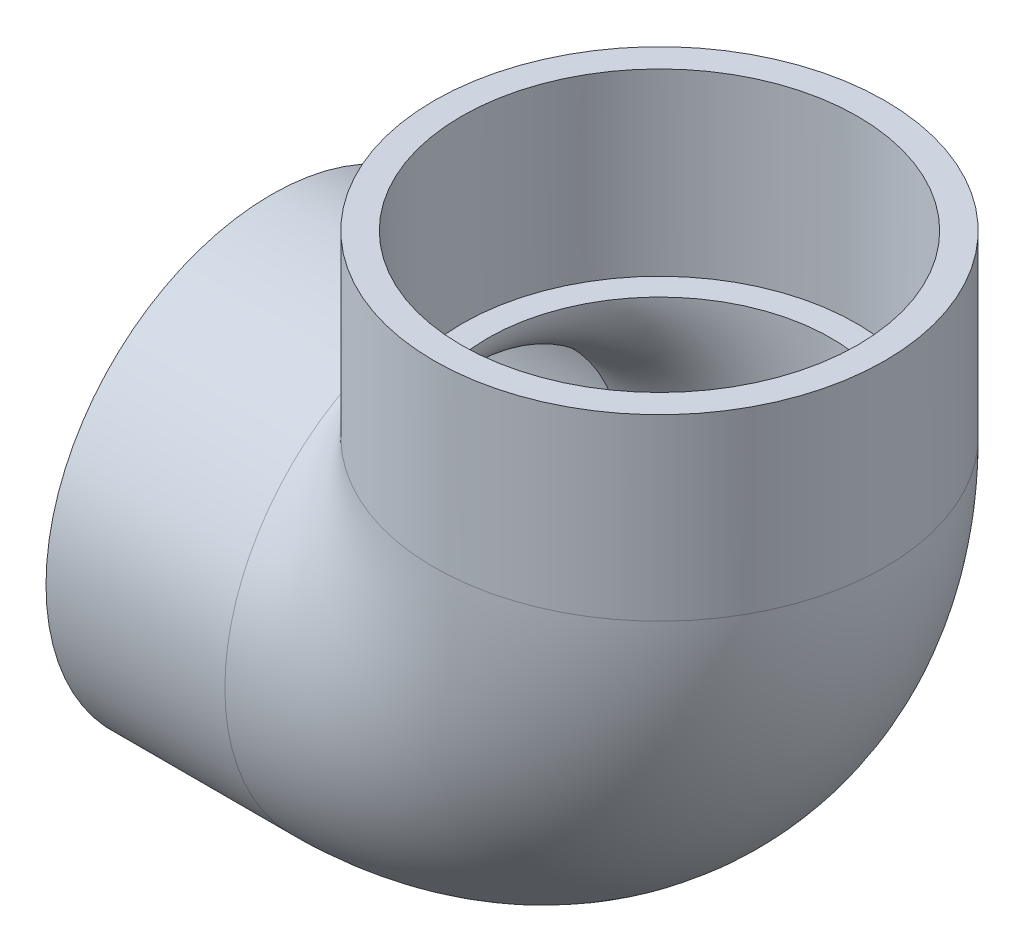
ISO-10303-21;
HEADER;
FILE_DESCRIPTION(('STEP AP214'),'2;1');
FILE_NAME('part.step','',(''),(''),'','','');
FILE_SCHEMA(('AUTOMOTIVE_DESIGN { 1 0 10303 214 1 1 1 1 }'));
ENDSEC;
DATA;
#1=APPLICATION_CONTEXT('core data for automotive mechanical design processes');
#2=APPLICATION_PROTOCOL_DEFINITION('international standard','automotive_design',2000,#1);
#3=PRODUCT_CONTEXT('',#1,'mechanical');
#4=PRODUCT('Part','Part','',(#3));
#5=PRODUCT_RELATED_PRODUCT_CATEGORY('part','',(#4));
#6=PRODUCT_DEFINITION_FORMATION('','',#4);
#7=PRODUCT_DEFINITION_CONTEXT('part definition',#1,'design');
#8=PRODUCT_DEFINITION('design','',#6,#7);
#9=PRODUCT_DEFINITION_SHAPE('','',#8);
#10=(LENGTH_UNIT() NAMED_UNIT(*) SI_UNIT(.MILLI.,.METRE.));
#11=(NAMED_UNIT(*) PLANE_ANGLE_UNIT() SI_UNIT($,.RADIAN.));
#12=(NAMED_UNIT(*) SI_UNIT($,.STERADIAN.) SOLID_ANGLE_UNIT());
#13=UNCERTAINTY_MEASURE_WITH_UNIT(LENGTH_MEASURE(1.E-05),#10,'distance_accuracy_value','');
#14=(GEOMETRIC_REPRESENTATION_CONTEXT(3) GLOBAL_UNCERTAINTY_ASSIGNED_CONTEXT((#13)) GLOBAL_UNIT_ASSIGNED_CONTEXT((#10,
#11,#12)) REPRESENTATION_CONTEXT('',''));
#15=CARTESIAN_POINT('',(0.,0.,0.));
#16=DIRECTION('',(0.,0.,1.));
#17=DIRECTION('',(1.,0.,0.));
#18=AXIS2_PLACEMENT_3D('',#15,#16,#17);
#19=CARTESIAN_POINT('',(-165.354,-96.012,0.));
#20=DIRECTION('',(-1.,0.,0.));
#21=DIRECTION('',(0.,0.,1.));
#22=AXIS2_PLACEMENT_3D('',#19,#20,#21);
#23=PLANE('',#22);
#24=CARTESIAN_POINT('',(-165.354,0.,0.));
#25=DIRECTION('',(-1.,0.,0.));
#26=DIRECTION('',(0.,0.,1.));
#27=AXIS2_PLACEMENT_3D('',#24,#25,#26);
#28=CIRCLE('',#27,96.012);
#29=CARTESIAN_POINT('',(-165.354,0.,96.012));
#30=VERTEX_POINT('',#29);
#31=EDGE_CURVE('E52',#30,#30,#28,.T.);
#32=ORIENTED_EDGE('',*,*,#31,.T.);
#33=EDGE_LOOP('',(#32));
#34=FACE_BOUND('',#33,.T.);
#35=CARTESIAN_POINT('',(-165.354,0.,0.));
#36=DIRECTION('',(-1.,0.,0.));
#37=DIRECTION('',(0.,0.,1.));
#38=AXIS2_PLACEMENT_3D('',#35,#36,#37);
#39=CIRCLE('',#38,84.4169);
#40=CARTESIAN_POINT('',(-165.354,0.,84.4169));
#41=VERTEX_POINT('',#40);
#42=EDGE_CURVE('E39',#41,#41,#39,.T.);
#43=ORIENTED_EDGE('',*,*,#42,.F.);
#44=EDGE_LOOP('',(#43));
#45=FACE_BOUND('',#44,.T.);
#46=ADVANCED_FACE('F32',(#34,#45),#23,.T.);
#47=CARTESIAN_POINT('',(-89.154,0.,0.));
#48=DIRECTION('',(-1.,0.,0.));
#49=DIRECTION('',(0.,0.,1.));
#50=AXIS2_PLACEMENT_3D('',#47,#48,#49);
#51=CONICAL_SURFACE('',#50,83.9978,0.00549994454267329);
#52=ORIENTED_EDGE('',*,*,#42,.T.);
#53=EDGE_LOOP('',(#52));
#54=FACE_BOUND('',#53,.T.);
#55=CARTESIAN_POINT('',(-89.154,0.,0.));
#56=DIRECTION('',(-1.,0.,0.));
#57=DIRECTION('',(0.,0.,1.));
#58=AXIS2_PLACEMENT_3D('',#55,#56,#57);
#59=CIRCLE('',#58,83.9978);
#60=CARTESIAN_POINT('',(-89.154,0.,83.9978));
#61=VERTEX_POINT('',#60);
#62=EDGE_CURVE('E63',#61,#61,#59,.T.);
#63=ORIENTED_EDGE('',*,*,#62,.F.);
#64=EDGE_LOOP('',(#63));
#65=FACE_BOUND('',#64,.T.);
#66=ADVANCED_FACE('F72',(#54,#65),#51,.F.);
#67=CARTESIAN_POINT('',(-165.354,0.,0.));
#68=DIRECTION('',(-1.,0.,0.));
#69=DIRECTION('',(0.,0.,1.));
#70=AXIS2_PLACEMENT_3D('',#67,#68,#69);
#71=CYLINDRICAL_SURFACE('',#70,96.012);
#72=CARTESIAN_POINT('',(0.,0.,0.));
#73=DIRECTION('',(-0.707106781186547,-0.707106781186547,0.));
#74=DIRECTION('',(-0.707106781186547,0.707106781186547,0.));
#75=AXIS2_PLACEMENT_3D('',#72,#73,#74);
#76=ELLIPSE('',#75,135.781472550566,96.012);
#77=CARTESIAN_POINT('',(-89.154,89.154,-35.635213314922));
#78=VERTEX_POINT('',#77);
#79=CARTESIAN_POINT('',(-89.154,89.154,35.6352133149221));
#80=VERTEX_POINT('',#79);
#81=EDGE_CURVE('E51',#78,#80,#76,.F.);
#82=ORIENTED_EDGE('',*,*,#81,.F.);
#83=CARTESIAN_POINT('',(-89.154,0.,0.));
#84=DIRECTION('',(-1.,0.,0.));
#85=DIRECTION('',(0.,0.,1.));
#86=AXIS2_PLACEMENT_3D('',#83,#84,#85);
#87=CIRCLE('',#86,96.012);
#88=EDGE_CURVE('E58',#78,#80,#87,.T.);
#89=ORIENTED_EDGE('',*,*,#88,.T.);
#90=EDGE_LOOP('',(#82,#89));
#91=FACE_BOUND('',#90,.T.);
#92=ORIENTED_EDGE('',*,*,#31,.F.);
#93=EDGE_LOOP('',(#92));
#94=FACE_BOUND('',#93,.T.);
#95=ADVANCED_FACE('F56',(#91,#94),#71,.T.);
#96=CARTESIAN_POINT('',(-89.154,89.154,0.));
#97=DIRECTION('',(0.,0.,-1.));
#98=DIRECTION('',(-1.,0.,0.));
#99=AXIS2_PLACEMENT_3D('',#96,#97,#98);
#100=TOROIDAL_SURFACE('',#99,89.154,73.1647);
#101=CARTESIAN_POINT('',(0.,89.154,0.));
#102=DIRECTION('',(0.,1.,0.));
#103=DIRECTION('',(0.,0.,-1.));
#104=AXIS2_PLACEMENT_3D('',#101,#102,#103);
#105=CIRCLE('',#104,73.1647);
#106=CARTESIAN_POINT('',(73.1647,89.154,0.));
#107=VERTEX_POINT('',#106);
#108=EDGE_CURVE('E53',#107,#107,#105,.T.);
#109=CARTESIAN_POINT('',(-89.154,0.,0.));
#110=DIRECTION('',(1.,0.,0.));
#111=DIRECTION('',(0.,0.,-1.));
#112=AXIS2_PLACEMENT_3D('',#109,#110,#111);
#113=CIRCLE('',#112,73.1647);
#114=CARTESIAN_POINT('',(-89.154,-73.1647,0.));
#115=VERTEX_POINT('',#114);
#116=EDGE_CURVE('E59',#115,#115,#113,.T.);
#117=CARTESIAN_POINT('',(-89.154,89.154,0.));
#118=DIRECTION('',(0.,0.,-1.));
#119=DIRECTION('',(-1.,0.,0.));
#120=AXIS2_PLACEMENT_3D('',#117,#118,#119);
#121=CIRCLE('',#120,162.3187);
#122=EDGE_CURVE('',#107,#115,#121,.T.);
#123=ORIENTED_EDGE('',*,*,#108,.T.);
#124=ORIENTED_EDGE('',*,*,#116,.F.);
#125=ORIENTED_EDGE('',*,*,#122,.T.);
#126=ORIENTED_EDGE('',*,*,#122,.F.);
#127=EDGE_LOOP('',(#123,#125,#124,#126));
#128=FACE_BOUND('',#127,.T.);
#129=ADVANCED_FACE('F82',(#128),#100,.F.);
#130=CARTESIAN_POINT('',(-178.308,89.154,0.));
#131=DIRECTION('',(0.,-1.,0.));
#132=DIRECTION('',(-1.,0.,0.));
#133=AXIS2_PLACEMENT_3D('',#130,#131,#132);
#134=CIRCLE('',#133,96.012);
#135=TRIMMED_CURVE('',#134,(PARAMETER_VALUE(-2.76134144689686)),
(PARAMETER_VALUE(2.76134144689686)),.T.,.PARAMETER.);
#136=CARTESIAN_POINT('',(-89.154,89.154,0.));
#137=DIRECTION('',(0.,0.,-1.));
#138=AXIS1_PLACEMENT('',#136,#137);
#139=SURFACE_OF_REVOLUTION('',#135,#138);
#140=CARTESIAN_POINT('',(0.,89.154,0.));
#141=DIRECTION('',(0.,1.,0.));
#142=DIRECTION('',(0.,0.,-1.));
#143=AXIS2_PLACEMENT_3D('',#140,#141,#142);
#144=CIRCLE('',#143,96.012);
#145=EDGE_CURVE('E45',#80,#78,#144,.T.);
#146=ORIENTED_EDGE('',*,*,#145,.F.);
#147=ORIENTED_EDGE('',*,*,#88,.F.);
#148=EDGE_LOOP('',(#146,#147));
#149=FACE_BOUND('',#148,.T.);
#150=ADVANCED_FACE('F62',(#149),#139,.T.);
#151=CARTESIAN_POINT('',(0.,89.154,0.));
#152=DIRECTION('',(0.,1.,0.));
#153=DIRECTION('',(0.,0.,-1.));
#154=AXIS2_PLACEMENT_3D('',#151,#152,#153);
#155=PLANE('',#154);
#156=CARTESIAN_POINT('',(0.,89.154,0.));
#157=DIRECTION('',(0.,1.,0.));
#158=DIRECTION('',(-1.,0.,0.));
#159=AXIS2_PLACEMENT_3D('',#156,#157,#158);
#160=CIRCLE('',#159,83.9978);
#161=CARTESIAN_POINT('',(-83.9978,89.154,0.));
#162=VERTEX_POINT('',#161);
#163=EDGE_CURVE('E11',#162,#162,#160,.F.);
#164=ORIENTED_EDGE('',*,*,#163,.F.);
#165=EDGE_LOOP('',(#164));
#166=FACE_BOUND('',#165,.T.);
#167=ORIENTED_EDGE('',*,*,#108,.F.);
#168=EDGE_LOOP('',(#167));
#169=FACE_BOUND('',#168,.T.);
#170=ADVANCED_FACE('F91',(#166,#169),#155,.T.);
#171=CARTESIAN_POINT('',(-89.154,0.,0.));
#172=DIRECTION('',(1.,0.,0.));
#173=DIRECTION('',(0.,0.,-1.));
#174=AXIS2_PLACEMENT_3D('',#171,#172,#173);
#175=PLANE('',#174);
#176=ORIENTED_EDGE('',*,*,#62,.T.);
#177=EDGE_LOOP('',(#176));
#178=FACE_BOUND('',#177,.T.);
#179=ORIENTED_EDGE('',*,*,#116,.T.);
#180=EDGE_LOOP('',(#179));
#181=FACE_BOUND('',#180,.T.);
#182=ADVANCED_FACE('F95',(#178,#181),#175,.F.);
#183=CARTESIAN_POINT('',(96.012,165.354,0.));
#184=DIRECTION('',(0.,1.,0.));
#185=DIRECTION('',(0.,0.,1.));
#186=AXIS2_PLACEMENT_3D('',#183,#184,#185);
#187=PLANE('',#186);
#188=CARTESIAN_POINT('',(0.,165.354,0.));
#189=DIRECTION('',(0.,-1.,0.));
#190=DIRECTION('',(0.,0.,-1.));
#191=AXIS2_PLACEMENT_3D('',#188,#189,#190);
#192=CIRCLE('',#191,84.4169);
#193=CARTESIAN_POINT('',(0.,165.354,-84.4169));
#194=VERTEX_POINT('',#193);
#195=EDGE_CURVE('E116',#194,#194,#192,.T.);
#196=ORIENTED_EDGE('',*,*,#195,.T.);
#197=EDGE_LOOP('',(#196));
#198=FACE_BOUND('',#197,.T.);
#199=CARTESIAN_POINT('',(0.,165.354,0.));
#200=DIRECTION('',(0.,-1.,0.));
#201=DIRECTION('',(0.,0.,-1.));
#202=AXIS2_PLACEMENT_3D('',#199,#200,#201);
#203=CIRCLE('',#202,96.012);
#204=CARTESIAN_POINT('',(0.,165.354,-96.012));
#205=VERTEX_POINT('',#204);
#206=EDGE_CURVE('E60',#205,#205,#203,.T.);
#207=ORIENTED_EDGE('',*,*,#206,.F.);
#208=EDGE_LOOP('',(#207));
#209=FACE_BOUND('',#208,.T.);
#210=ADVANCED_FACE('F99',(#198,#209),#187,.T.);
#211=CARTESIAN_POINT('',(0.,0.,0.));
#212=DIRECTION('',(0.,-1.,0.));
#213=DIRECTION('',(0.,0.,-1.));
#214=AXIS2_PLACEMENT_3D('',#211,#212,#213);
#215=CYLINDRICAL_SURFACE('',#214,96.012);
#216=ORIENTED_EDGE('',*,*,#206,.T.);
#217=EDGE_LOOP('',(#216));
#218=FACE_BOUND('',#217,.T.);
#219=ORIENTED_EDGE('',*,*,#145,.T.);
#220=ORIENTED_EDGE('',*,*,#81,.T.);
#221=EDGE_LOOP('',(#219,#220));
#222=FACE_BOUND('',#221,.T.);
#223=ADVANCED_FACE('F50',(#218,#222),#215,.T.);
#224=CARTESIAN_POINT('',(0.,165.354,0.));
#225=DIRECTION('',(0.,1.,0.));
#226=DIRECTION('',(0.,0.,1.));
#227=AXIS2_PLACEMENT_3D('',#224,#225,#226);
#228=CONICAL_SURFACE('',#227,84.4169,0.00549994454267329);
#229=ORIENTED_EDGE('',*,*,#163,.T.);
#230=EDGE_LOOP('',(#229));
#231=FACE_BOUND('',#230,.T.);
#232=ORIENTED_EDGE('',*,*,#195,.F.);
#233=EDGE_LOOP('',(#232));
#234=FACE_BOUND('',#233,.T.);
#235=ADVANCED_FACE('F106',(#231,#234),#228,.F.);
#236=CLOSED_SHELL('',(#46,#66,#95,#129,#150,#170,#182,#210,#223,#235));
#237=MANIFOLD_SOLID_BREP('B2',#236);
#238=ADVANCED_BREP_SHAPE_REPRESENTATION('',(#18,#237),#14);
#239=SHAPE_DEFINITION_REPRESENTATION(#9,#238);
ENDSEC;
END-ISO-10303-21;
